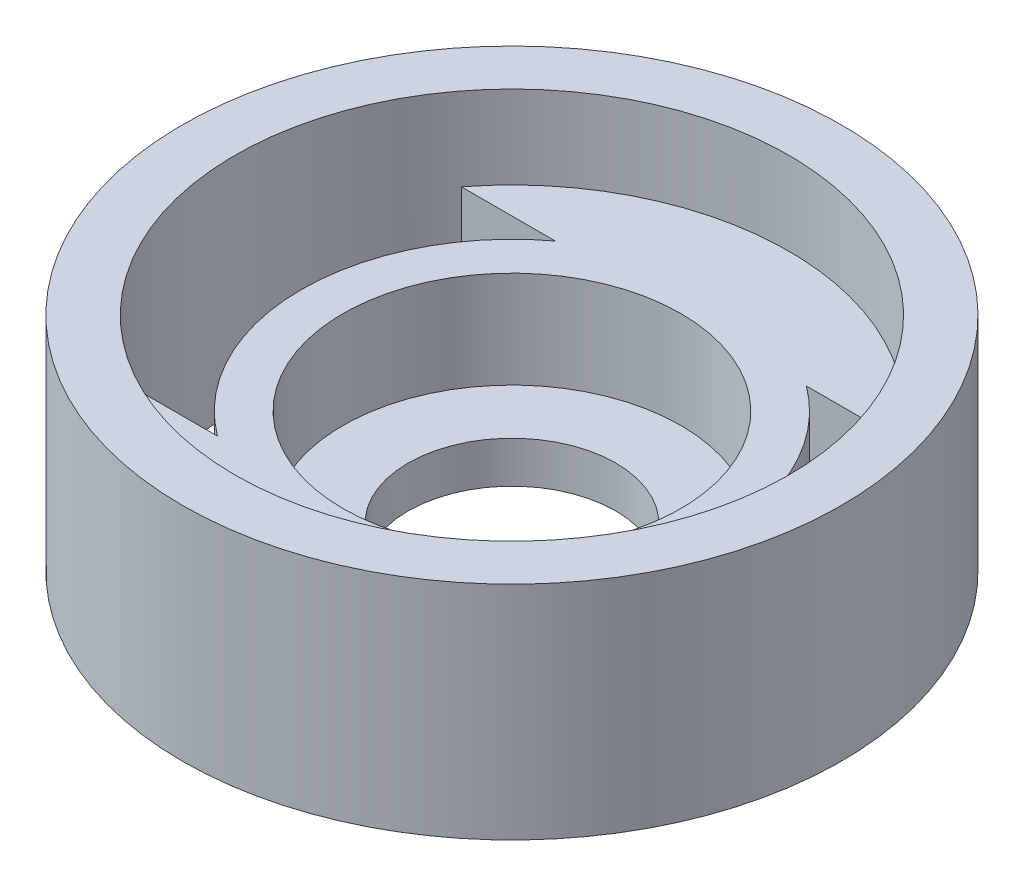
ISO-10303-21;
HEADER;
FILE_DESCRIPTION(('STEP AP214'),'2;1');
FILE_NAME('part.step','',(''),(''),'','','');
FILE_SCHEMA(('AUTOMOTIVE_DESIGN { 1 0 10303 214 1 1 1 1 }'));
ENDSEC;
DATA;
#1=APPLICATION_CONTEXT('core data for automotive mechanical design processes');
#2=APPLICATION_PROTOCOL_DEFINITION('international standard','automotive_design',2000,#1);
#3=PRODUCT_CONTEXT('',#1,'mechanical');
#4=PRODUCT('Part','Part','',(#3));
#5=PRODUCT_RELATED_PRODUCT_CATEGORY('part','',(#4));
#6=PRODUCT_DEFINITION_FORMATION('','',#4);
#7=PRODUCT_DEFINITION_CONTEXT('part definition',#1,'design');
#8=PRODUCT_DEFINITION('design','',#6,#7);
#9=PRODUCT_DEFINITION_SHAPE('','',#8);
#10=(LENGTH_UNIT() NAMED_UNIT(*) SI_UNIT(.MILLI.,.METRE.));
#11=(NAMED_UNIT(*) PLANE_ANGLE_UNIT() SI_UNIT($,.RADIAN.));
#12=(NAMED_UNIT(*) SI_UNIT($,.STERADIAN.) SOLID_ANGLE_UNIT());
#13=UNCERTAINTY_MEASURE_WITH_UNIT(LENGTH_MEASURE(1.E-05),#10,'distance_accuracy_value','');
#14=(GEOMETRIC_REPRESENTATION_CONTEXT(3) GLOBAL_UNCERTAINTY_ASSIGNED_CONTEXT((#13)) GLOBAL_UNIT_ASSIGNED_CONTEXT((#10,
#11,#12)) REPRESENTATION_CONTEXT('',''));
#15=CARTESIAN_POINT('',(0.,0.,0.));
#16=DIRECTION('',(0.,0.,1.));
#17=DIRECTION('',(1.,0.,0.));
#18=AXIS2_PLACEMENT_3D('',#15,#16,#17);
#19=CARTESIAN_POINT('',(0.,10.,0.));
#20=DIRECTION('',(0.,1.,0.));
#21=DIRECTION('',(0.,0.,1.));
#22=AXIS2_PLACEMENT_3D('',#19,#20,#21);
#23=PLANE('',#22);
#24=CARTESIAN_POINT('',(0.,10.,0.));
#25=DIRECTION('',(0.,1.,0.));
#26=DIRECTION('',(0.,0.,1.));
#27=AXIS2_PLACEMENT_3D('',#24,#25,#26);
#28=CIRCLE('',#27,12.2);
#29=CARTESIAN_POINT('',(0.,10.,12.2));
#30=VERTEX_POINT('',#29);
#31=EDGE_CURVE('E167',#30,#30,#28,.T.);
#32=ORIENTED_EDGE('',*,*,#31,.F.);
#33=EDGE_LOOP('',(#32));
#34=FACE_BOUND('',#33,.T.);
#35=CARTESIAN_POINT('',(0.,10.,0.));
#36=DIRECTION('',(0.,1.,0.));
#37=DIRECTION('',(0.,0.,1.));
#38=AXIS2_PLACEMENT_3D('',#35,#36,#37);
#39=CIRCLE('',#38,15.2);
#40=CARTESIAN_POINT('',(-9.06642156531451,10.,-12.2));
#41=VERTEX_POINT('',#40);
#42=CARTESIAN_POINT('',(-9.06642156531451,10.,12.2));
#43=VERTEX_POINT('',#42);
#44=EDGE_CURVE('E119',#41,#43,#39,.T.);
#45=ORIENTED_EDGE('',*,*,#44,.T.);
#46=DIRECTION('',(-1.,0.,0.));
#47=VECTOR('',#46,1.);
#48=CARTESIAN_POINT('',(0.,10.,12.2));
#49=LINE('',#48,#47);
#50=CARTESIAN_POINT('',(-15.848028268526,10.,12.2));
#51=VERTEX_POINT('',#50);
#52=EDGE_CURVE('E116',#43,#51,#49,.T.);
#53=ORIENTED_EDGE('',*,*,#52,.T.);
#54=CARTESIAN_POINT('',(0.,10.,0.));
#55=DIRECTION('',(0.,1.,0.));
#56=DIRECTION('',(0.,0.,1.));
#57=AXIS2_PLACEMENT_3D('',#54,#55,#56);
#58=CIRCLE('',#57,20.);
#59=CARTESIAN_POINT('',(15.848028268526,10.,12.2));
#60=VERTEX_POINT('',#59);
#61=EDGE_CURVE('E170',#60,#51,#58,.F.);
#62=ORIENTED_EDGE('',*,*,#61,.F.);
#63=DIRECTION('',(-1.,0.,0.));
#64=VECTOR('',#63,1.);
#65=CARTESIAN_POINT('',(0.,10.,12.2));
#66=LINE('',#65,#64);
#67=CARTESIAN_POINT('',(9.06642156531451,10.,12.2));
#68=VERTEX_POINT('',#67);
#69=EDGE_CURVE('E144',#60,#68,#66,.T.);
#70=ORIENTED_EDGE('',*,*,#69,.T.);
#71=CARTESIAN_POINT('',(0.,10.,0.));
#72=DIRECTION('',(0.,1.,0.));
#73=DIRECTION('',(0.,0.,1.));
#74=AXIS2_PLACEMENT_3D('',#71,#72,#73);
#75=CIRCLE('',#74,15.2);
#76=CARTESIAN_POINT('',(9.06642156531451,10.,-12.2));
#77=VERTEX_POINT('',#76);
#78=EDGE_CURVE('E141',#68,#77,#75,.T.);
#79=ORIENTED_EDGE('',*,*,#78,.T.);
#80=DIRECTION('',(1.,0.,0.));
#81=VECTOR('',#80,1.);
#82=CARTESIAN_POINT('',(0.,10.,-12.2));
#83=LINE('',#82,#81);
#84=CARTESIAN_POINT('',(15.848028268526,10.,-12.2));
#85=VERTEX_POINT('',#84);
#86=EDGE_CURVE('E148',#77,#85,#83,.T.);
#87=ORIENTED_EDGE('',*,*,#86,.T.);
#88=CARTESIAN_POINT('',(-15.848028268526,10.,-12.2));
#89=VERTEX_POINT('',#88);
#90=EDGE_CURVE('E131',#89,#85,#58,.F.);
#91=ORIENTED_EDGE('',*,*,#90,.F.);
#92=DIRECTION('',(-1.,0.,0.));
#93=VECTOR('',#92,1.);
#94=CARTESIAN_POINT('',(0.,10.,-12.2));
#95=LINE('',#94,#93);
#96=EDGE_CURVE('E111',#41,#89,#95,.T.);
#97=ORIENTED_EDGE('',*,*,#96,.F.);
#98=EDGE_LOOP('',(#45,#53,#62,#70,#79,#87,#91,#97));
#99=FACE_BOUND('',#98,.T.);
#100=ADVANCED_FACE('F45',(#34,#99),#23,.T.);
#101=CARTESIAN_POINT('',(0.,0.,0.));
#102=DIRECTION('',(0.,1.,0.));
#103=DIRECTION('',(0.,0.,1.));
#104=AXIS2_PLACEMENT_3D('',#101,#102,#103);
#105=PLANE('',#104);
#106=CARTESIAN_POINT('',(0.,0.,0.));
#107=DIRECTION('',(0.,1.,0.));
#108=DIRECTION('',(0.,0.,1.));
#109=AXIS2_PLACEMENT_3D('',#106,#107,#108);
#110=CIRCLE('',#109,15.2);
#111=CARTESIAN_POINT('',(9.06642156531451,0.,12.2));
#112=VERTEX_POINT('',#111);
#113=CARTESIAN_POINT('',(9.06642156531451,0.,-12.2));
#114=VERTEX_POINT('',#113);
#115=EDGE_CURVE('E180',#112,#114,#110,.T.);
#116=ORIENTED_EDGE('',*,*,#115,.F.);
#117=DIRECTION('',(-1.,0.,0.));
#118=VECTOR('',#117,1.);
#119=CARTESIAN_POINT('',(0.,0.,12.2));
#120=LINE('',#119,#118);
#121=CARTESIAN_POINT('',(15.848028268526,0.,12.2));
#122=VERTEX_POINT('',#121);
#123=EDGE_CURVE('E173',#122,#112,#120,.T.);
#124=ORIENTED_EDGE('',*,*,#123,.F.);
#125=CARTESIAN_POINT('',(0.,0.,0.));
#126=DIRECTION('',(0.,1.,0.));
#127=DIRECTION('',(0.,0.,1.));
#128=AXIS2_PLACEMENT_3D('',#125,#126,#127);
#129=CIRCLE('',#128,20.);
#130=CARTESIAN_POINT('',(15.848028268526,0.,-12.2));
#131=VERTEX_POINT('',#130);
#132=EDGE_CURVE('E175',#122,#131,#129,.T.);
#133=ORIENTED_EDGE('',*,*,#132,.T.);
#134=DIRECTION('',(1.,0.,0.));
#135=VECTOR('',#134,1.);
#136=CARTESIAN_POINT('',(0.,0.,-12.2));
#137=LINE('',#136,#135);
#138=EDGE_CURVE('E178',#114,#131,#137,.T.);
#139=ORIENTED_EDGE('',*,*,#138,.F.);
#140=EDGE_LOOP('',(#116,#124,#133,#139));
#141=FACE_BOUND('',#140,.T.);
#142=CARTESIAN_POINT('',(0.,0.,0.));
#143=DIRECTION('',(0.,1.,0.));
#144=DIRECTION('',(0.,0.,1.));
#145=AXIS2_PLACEMENT_3D('',#142,#143,#144);
#146=CIRCLE('',#145,7.5);
#147=CARTESIAN_POINT('',(0.,0.,7.5));
#148=VERTEX_POINT('',#147);
#149=EDGE_CURVE('E159',#148,#148,#146,.T.);
#150=ORIENTED_EDGE('',*,*,#149,.T.);
#151=EDGE_LOOP('',(#150));
#152=FACE_BOUND('',#151,.T.);
#153=CARTESIAN_POINT('',(0.,0.,0.));
#154=DIRECTION('',(0.,1.,0.));
#155=DIRECTION('',(0.,0.,1.));
#156=AXIS2_PLACEMENT_3D('',#153,#154,#155);
#157=CIRCLE('',#156,15.2);
#158=CARTESIAN_POINT('',(-9.06642156531451,0.,-12.2));
#159=VERTEX_POINT('',#158);
#160=CARTESIAN_POINT('',(-9.06642156531451,0.,12.2));
#161=VERTEX_POINT('',#160);
#162=EDGE_CURVE('E12',#159,#161,#157,.T.);
#163=ORIENTED_EDGE('',*,*,#162,.F.);
#164=DIRECTION('',(-1.,0.,0.));
#165=VECTOR('',#164,1.);
#166=CARTESIAN_POINT('',(0.,0.,-12.2));
#167=LINE('',#166,#165);
#168=CARTESIAN_POINT('',(-15.848028268526,0.,-12.2));
#169=VERTEX_POINT('',#168);
#170=EDGE_CURVE('E113',#159,#169,#167,.T.);
#171=ORIENTED_EDGE('',*,*,#170,.T.);
#172=CARTESIAN_POINT('',(0.,0.,0.));
#173=DIRECTION('',(0.,1.,0.));
#174=DIRECTION('',(0.,0.,1.));
#175=AXIS2_PLACEMENT_3D('',#172,#173,#174);
#176=CIRCLE('',#175,20.);
#177=CARTESIAN_POINT('',(-15.848028268526,0.,12.2));
#178=VERTEX_POINT('',#177);
#179=EDGE_CURVE('E183',#169,#178,#176,.T.);
#180=ORIENTED_EDGE('',*,*,#179,.T.);
#181=DIRECTION('',(-1.,0.,0.));
#182=VECTOR('',#181,1.);
#183=CARTESIAN_POINT('',(0.,0.,12.2));
#184=LINE('',#183,#182);
#185=EDGE_CURVE('E53',#161,#178,#184,.T.);
#186=ORIENTED_EDGE('',*,*,#185,.F.);
#187=EDGE_LOOP('',(#163,#171,#180,#186));
#188=FACE_BOUND('',#187,.T.);
#189=CARTESIAN_POINT('',(0.,0.,0.));
#190=DIRECTION('',(0.,1.,0.));
#191=DIRECTION('',(0.,0.,1.));
#192=AXIS2_PLACEMENT_3D('',#189,#190,#191);
#193=CIRCLE('',#192,23.8);
#194=CARTESIAN_POINT('',(0.,0.,23.8));
#195=VERTEX_POINT('',#194);
#196=EDGE_CURVE('E145',#195,#195,#193,.F.);
#197=ORIENTED_EDGE('',*,*,#196,.T.);
#198=EDGE_LOOP('',(#197));
#199=FACE_BOUND('',#198,.T.);
#200=ADVANCED_FACE('F47',(#141,#152,#188,#199),#105,.F.);
#201=CARTESIAN_POINT('',(0.,10.,0.));
#202=DIRECTION('',(0.,-1.,0.));
#203=DIRECTION('',(0.,0.,-1.));
#204=AXIS2_PLACEMENT_3D('',#201,#202,#203);
#205=CYLINDRICAL_SURFACE('',#204,12.2);
#206=ORIENTED_EDGE('',*,*,#31,.T.);
#207=EDGE_LOOP('',(#206));
#208=FACE_BOUND('',#207,.T.);
#209=CARTESIAN_POINT('',(0.,3.,0.));
#210=DIRECTION('',(0.,-1.,0.));
#211=DIRECTION('',(0.,0.,-1.));
#212=AXIS2_PLACEMENT_3D('',#209,#210,#211);
#213=CIRCLE('',#212,12.2);
#214=CARTESIAN_POINT('',(0.,3.,-12.2));
#215=VERTEX_POINT('',#214);
#216=EDGE_CURVE('E162',#215,#215,#213,.T.);
#217=ORIENTED_EDGE('',*,*,#216,.T.);
#218=EDGE_LOOP('',(#217));
#219=FACE_BOUND('',#218,.T.);
#220=ADVANCED_FACE('F195',(#208,#219),#205,.F.);
#221=CARTESIAN_POINT('',(0.,3.,0.));
#222=DIRECTION('',(0.,-1.,0.));
#223=DIRECTION('',(0.,0.,-1.));
#224=AXIS2_PLACEMENT_3D('',#221,#222,#223);
#225=PLANE('',#224);
#226=CARTESIAN_POINT('',(0.,3.,0.));
#227=DIRECTION('',(0.,1.,0.));
#228=DIRECTION('',(0.,0.,1.));
#229=AXIS2_PLACEMENT_3D('',#226,#227,#228);
#230=CIRCLE('',#229,7.5);
#231=CARTESIAN_POINT('',(0.,3.,7.5));
#232=VERTEX_POINT('',#231);
#233=EDGE_CURVE('E158',#232,#232,#230,.T.);
#234=ORIENTED_EDGE('',*,*,#233,.F.);
#235=EDGE_LOOP('',(#234));
#236=FACE_BOUND('',#235,.T.);
#237=ORIENTED_EDGE('',*,*,#216,.F.);
#238=EDGE_LOOP('',(#237));
#239=FACE_BOUND('',#238,.T.);
#240=ADVANCED_FACE('F223',(#236,#239),#225,.F.);
#241=CARTESIAN_POINT('',(0.,0.,0.));
#242=DIRECTION('',(0.,1.,0.));
#243=DIRECTION('',(0.,0.,1.));
#244=AXIS2_PLACEMENT_3D('',#241,#242,#243);
#245=CYLINDRICAL_SURFACE('',#244,7.5);
#246=ORIENTED_EDGE('',*,*,#149,.F.);
#247=EDGE_LOOP('',(#246));
#248=FACE_BOUND('',#247,.T.);
#249=ORIENTED_EDGE('',*,*,#233,.T.);
#250=EDGE_LOOP('',(#249));
#251=FACE_BOUND('',#250,.T.);
#252=ADVANCED_FACE('F227',(#248,#251),#245,.F.);
#253=CARTESIAN_POINT('',(0.,16.,0.));
#254=DIRECTION('',(0.,1.,0.));
#255=DIRECTION('',(0.,0.,1.));
#256=AXIS2_PLACEMENT_3D('',#253,#254,#255);
#257=PLANE('',#256);
#258=CARTESIAN_POINT('',(0.,16.,0.));
#259=DIRECTION('',(0.,1.,0.));
#260=DIRECTION('',(0.,0.,1.));
#261=AXIS2_PLACEMENT_3D('',#258,#259,#260);
#262=CIRCLE('',#261,20.);
#263=CARTESIAN_POINT('',(0.,16.,20.));
#264=VERTEX_POINT('',#263);
#265=EDGE_CURVE('E137',#264,#264,#262,.T.);
#266=ORIENTED_EDGE('',*,*,#265,.F.);
#267=EDGE_LOOP('',(#266));
#268=FACE_BOUND('',#267,.T.);
#269=CARTESIAN_POINT('',(0.,16.,0.));
#270=DIRECTION('',(0.,1.,0.));
#271=DIRECTION('',(0.,0.,1.));
#272=AXIS2_PLACEMENT_3D('',#269,#270,#271);
#273=CIRCLE('',#272,23.8);
#274=CARTESIAN_POINT('',(0.,16.,23.8));
#275=VERTEX_POINT('',#274);
#276=EDGE_CURVE('E200',#275,#275,#273,.T.);
#277=ORIENTED_EDGE('',*,*,#276,.T.);
#278=EDGE_LOOP('',(#277));
#279=FACE_BOUND('',#278,.T.);
#280=ADVANCED_FACE('F205',(#268,#279),#257,.T.);
#281=CARTESIAN_POINT('',(0.,16.,0.));
#282=DIRECTION('',(0.,-1.,0.));
#283=DIRECTION('',(0.,0.,-1.));
#284=AXIS2_PLACEMENT_3D('',#281,#282,#283);
#285=CYLINDRICAL_SURFACE('',#284,20.);
#286=ORIENTED_EDGE('',*,*,#265,.T.);
#287=EDGE_LOOP('',(#286));
#288=FACE_BOUND('',#287,.T.);
#289=ORIENTED_EDGE('',*,*,#61,.T.);
#290=DIRECTION('',(0.,1.,0.));
#291=VECTOR('',#290,1.);
#292=CARTESIAN_POINT('',(-15.848028268526,-49.,12.2));
#293=LINE('',#292,#291);
#294=EDGE_CURVE('E138',#178,#51,#293,.T.);
#295=ORIENTED_EDGE('',*,*,#294,.F.);
#296=ORIENTED_EDGE('',*,*,#179,.F.);
#297=DIRECTION('',(0.,1.,0.));
#298=VECTOR('',#297,1.);
#299=CARTESIAN_POINT('',(-15.848028268526,-49.,-12.2));
#300=LINE('',#299,#298);
#301=EDGE_CURVE('E60',#169,#89,#300,.T.);
#302=ORIENTED_EDGE('',*,*,#301,.T.);
#303=ORIENTED_EDGE('',*,*,#90,.T.);
#304=DIRECTION('',(0.,1.,0.));
#305=VECTOR('',#304,1.);
#306=CARTESIAN_POINT('',(15.848028268526,-49.,-12.2));
#307=LINE('',#306,#305);
#308=EDGE_CURVE('E152',#131,#85,#307,.T.);
#309=ORIENTED_EDGE('',*,*,#308,.F.);
#310=ORIENTED_EDGE('',*,*,#132,.F.);
#311=DIRECTION('',(0.,1.,0.));
#312=VECTOR('',#311,1.);
#313=CARTESIAN_POINT('',(15.848028268526,-49.,12.2));
#314=LINE('',#313,#312);
#315=EDGE_CURVE('E68',#122,#60,#314,.T.);
#316=ORIENTED_EDGE('',*,*,#315,.T.);
#317=EDGE_LOOP('',(#289,#295,#296,#302,#303,#309,#310,#316));
#318=FACE_BOUND('',#317,.T.);
#319=ADVANCED_FACE('F191',(#288,#318),#285,.F.);
#320=CARTESIAN_POINT('',(0.,-49.,0.));
#321=DIRECTION('',(0.,1.,0.));
#322=DIRECTION('',(0.,0.,1.));
#323=AXIS2_PLACEMENT_3D('',#320,#321,#322);
#324=CYLINDRICAL_SURFACE('',#323,15.2);
#325=ORIENTED_EDGE('',*,*,#115,.T.);
#326=DIRECTION('',(0.,1.,0.));
#327=VECTOR('',#326,1.);
#328=CARTESIAN_POINT('',(9.06642156531451,-49.,-12.2));
#329=LINE('',#328,#327);
#330=EDGE_CURVE('E126',#114,#77,#329,.T.);
#331=ORIENTED_EDGE('',*,*,#330,.T.);
#332=ORIENTED_EDGE('',*,*,#78,.F.);
#333=DIRECTION('',(0.,1.,0.));
#334=VECTOR('',#333,1.);
#335=CARTESIAN_POINT('',(9.06642156531451,-49.,12.2));
#336=LINE('',#335,#334);
#337=EDGE_CURVE('E150',#112,#68,#336,.T.);
#338=ORIENTED_EDGE('',*,*,#337,.F.);
#339=EDGE_LOOP('',(#325,#331,#332,#338));
#340=FACE_BOUND('',#339,.T.);
#341=ADVANCED_FACE('F237',(#340),#324,.T.);
#342=CARTESIAN_POINT('',(0.,-49.,-12.2));
#343=DIRECTION('',(0.,0.,1.));
#344=DIRECTION('',(1.,0.,0.));
#345=AXIS2_PLACEMENT_3D('',#342,#343,#344);
#346=PLANE('',#345);
#347=ORIENTED_EDGE('',*,*,#138,.T.);
#348=ORIENTED_EDGE('',*,*,#308,.T.);
#349=ORIENTED_EDGE('',*,*,#86,.F.);
#350=ORIENTED_EDGE('',*,*,#330,.F.);
#351=EDGE_LOOP('',(#347,#348,#349,#350));
#352=FACE_BOUND('',#351,.T.);
#353=ADVANCED_FACE('F241',(#352),#346,.T.);
#354=CARTESIAN_POINT('',(0.,-49.,12.2));
#355=DIRECTION('',(0.,0.,-1.));
#356=DIRECTION('',(-1.,0.,0.));
#357=AXIS2_PLACEMENT_3D('',#354,#355,#356);
#358=PLANE('',#357);
#359=ORIENTED_EDGE('',*,*,#123,.T.);
#360=ORIENTED_EDGE('',*,*,#337,.T.);
#361=ORIENTED_EDGE('',*,*,#69,.F.);
#362=ORIENTED_EDGE('',*,*,#315,.F.);
#363=EDGE_LOOP('',(#359,#360,#361,#362));
#364=FACE_BOUND('',#363,.T.);
#365=ADVANCED_FACE('F243',(#364),#358,.T.);
#366=CARTESIAN_POINT('',(0.,-49.,0.));
#367=DIRECTION('',(0.,1.,0.));
#368=DIRECTION('',(0.,0.,1.));
#369=AXIS2_PLACEMENT_3D('',#366,#367,#368);
#370=CYLINDRICAL_SURFACE('',#369,15.2);
#371=ORIENTED_EDGE('',*,*,#162,.T.);
#372=DIRECTION('',(0.,1.,0.));
#373=VECTOR('',#372,1.);
#374=CARTESIAN_POINT('',(-9.06642156531451,-49.,12.2));
#375=LINE('',#374,#373);
#376=EDGE_CURVE('E122',#161,#43,#375,.T.);
#377=ORIENTED_EDGE('',*,*,#376,.T.);
#378=ORIENTED_EDGE('',*,*,#44,.F.);
#379=DIRECTION('',(0.,1.,0.));
#380=VECTOR('',#379,1.);
#381=CARTESIAN_POINT('',(-9.06642156531451,-49.,-12.2));
#382=LINE('',#381,#380);
#383=EDGE_CURVE('E107',#159,#41,#382,.T.);
#384=ORIENTED_EDGE('',*,*,#383,.F.);
#385=EDGE_LOOP('',(#371,#377,#378,#384));
#386=FACE_BOUND('',#385,.T.);
#387=ADVANCED_FACE('F120',(#386),#370,.T.);
#388=CARTESIAN_POINT('',(0.,-49.,12.2));
#389=DIRECTION('',(0.,0.,-1.));
#390=DIRECTION('',(-1.,0.,0.));
#391=AXIS2_PLACEMENT_3D('',#388,#389,#390);
#392=PLANE('',#391);
#393=ORIENTED_EDGE('',*,*,#185,.T.);
#394=ORIENTED_EDGE('',*,*,#294,.T.);
#395=ORIENTED_EDGE('',*,*,#52,.F.);
#396=ORIENTED_EDGE('',*,*,#376,.F.);
#397=EDGE_LOOP('',(#393,#394,#395,#396));
#398=FACE_BOUND('',#397,.T.);
#399=ADVANCED_FACE('F188',(#398),#392,.T.);
#400=CARTESIAN_POINT('',(0.,-49.,-12.2));
#401=DIRECTION('',(0.,0.,-1.));
#402=DIRECTION('',(-1.,0.,0.));
#403=AXIS2_PLACEMENT_3D('',#400,#401,#402);
#404=PLANE('',#403);
#405=ORIENTED_EDGE('',*,*,#383,.T.);
#406=ORIENTED_EDGE('',*,*,#96,.T.);
#407=ORIENTED_EDGE('',*,*,#301,.F.);
#408=ORIENTED_EDGE('',*,*,#170,.F.);
#409=EDGE_LOOP('',(#405,#406,#407,#408));
#410=FACE_BOUND('',#409,.T.);
#411=ADVANCED_FACE('F109',(#410),#404,.F.);
#412=CARTESIAN_POINT('',(0.,-67.3165655689593,0.));
#413=DIRECTION('',(0.,1.,0.));
#414=DIRECTION('',(0.,0.,1.));
#415=AXIS2_PLACEMENT_3D('',#412,#413,#414);
#416=CYLINDRICAL_SURFACE('',#415,23.8);
#417=ORIENTED_EDGE('',*,*,#196,.F.);
#418=EDGE_LOOP('',(#417));
#419=FACE_BOUND('',#418,.T.);
#420=ORIENTED_EDGE('',*,*,#276,.F.);
#421=EDGE_LOOP('',(#420));
#422=FACE_BOUND('',#421,.T.);
#423=ADVANCED_FACE('F207',(#419,#422),#416,.T.);
#424=CLOSED_SHELL('',(#100,#200,#220,#240,#252,#280,#319,#341,#353,#365,#387,#399,#411,#423));
#425=MANIFOLD_SOLID_BREP('B2',#424);
#426=ADVANCED_BREP_SHAPE_REPRESENTATION('',(#18,#425),#14);
#427=SHAPE_DEFINITION_REPRESENTATION(#9,#426);
ENDSEC;
END-ISO-10303-21;
